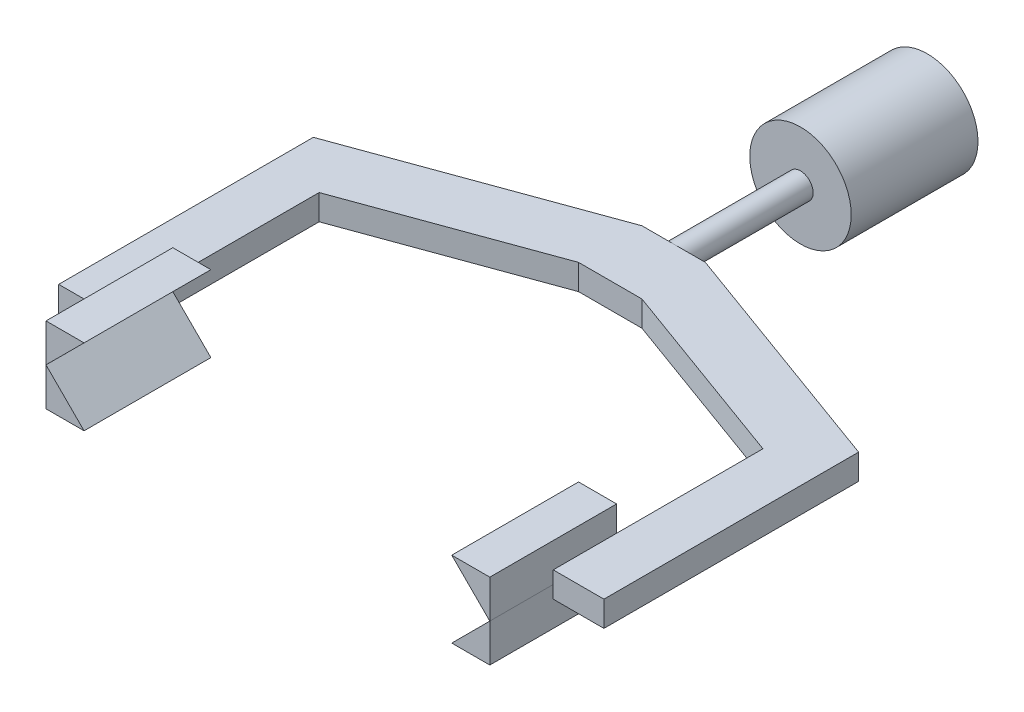
ISO-10303-21;
HEADER;
FILE_DESCRIPTION(('STEP AP214'),'2;1');
FILE_NAME('part.step','',(''),(''),'','','');
FILE_SCHEMA(('AUTOMOTIVE_DESIGN { 1 0 10303 214 1 1 1 1 }'));
ENDSEC;
DATA;
#1=APPLICATION_CONTEXT('core data for automotive mechanical design processes');
#2=APPLICATION_PROTOCOL_DEFINITION('international standard','automotive_design',2000,#1);
#3=PRODUCT_CONTEXT('',#1,'mechanical');
#4=PRODUCT('Part','Part','',(#3));
#5=PRODUCT_RELATED_PRODUCT_CATEGORY('part','',(#4));
#6=PRODUCT_DEFINITION_FORMATION('','',#4);
#7=PRODUCT_DEFINITION_CONTEXT('part definition',#1,'design');
#8=PRODUCT_DEFINITION('design','',#6,#7);
#9=PRODUCT_DEFINITION_SHAPE('','',#8);
#10=(LENGTH_UNIT() NAMED_UNIT(*) SI_UNIT(.MILLI.,.METRE.));
#11=(NAMED_UNIT(*) PLANE_ANGLE_UNIT() SI_UNIT($,.RADIAN.));
#12=(NAMED_UNIT(*) SI_UNIT($,.STERADIAN.) SOLID_ANGLE_UNIT());
#13=UNCERTAINTY_MEASURE_WITH_UNIT(LENGTH_MEASURE(1.E-05),#10,'distance_accuracy_value','');
#14=(GEOMETRIC_REPRESENTATION_CONTEXT(3) GLOBAL_UNCERTAINTY_ASSIGNED_CONTEXT((#13)) GLOBAL_UNIT_ASSIGNED_CONTEXT((#10,
#11,#12)) REPRESENTATION_CONTEXT('',''));
#15=CARTESIAN_POINT('',(0.,0.,0.));
#16=DIRECTION('',(0.,0.,1.));
#17=DIRECTION('',(1.,0.,0.));
#18=AXIS2_PLACEMENT_3D('',#15,#16,#17);
#19=CARTESIAN_POINT('',(-8.743160098785,8.75141339961099,52.));
#20=DIRECTION('',(-0.70677311538271,0.707440289616176,0.));
#21=DIRECTION('',(-0.707440289616176,-0.70677311538271,0.));
#22=AXIS2_PLACEMENT_3D('',#19,#20,#21);
#23=PLANE('',#22);
#24=DIRECTION('',(0.707440289616176,0.70677311538271,0.));
#25=VECTOR('',#24,1.);
#26=CARTESIAN_POINT('',(-8.743160098785,8.75141339961099,42.));
#27=LINE('',#26,#25);
#28=CARTESIAN_POINT('',(-17.5,0.00283191685819875,42.));
#29=VERTEX_POINT('',#28);
#30=CARTESIAN_POINT('',(-14.4971680831418,3.0028319168582,42.));
#31=VERTEX_POINT('',#30);
#32=EDGE_CURVE('E93',#29,#31,#27,.T.);
#33=ORIENTED_EDGE('',*,*,#32,.T.);
#34=DIRECTION('',(0.,0.,-1.));
#35=VECTOR('',#34,1.);
#36=CARTESIAN_POINT('',(-14.4971680831418,3.0028319168582,52.));
#37=LINE('',#36,#35);
#38=CARTESIAN_POINT('',(-14.4971680831418,3.0028319168582,52.));
#39=VERTEX_POINT('',#38);
#40=EDGE_CURVE('E12',#39,#31,#37,.T.);
#41=ORIENTED_EDGE('',*,*,#40,.F.);
#42=DIRECTION('',(0.707440289616176,0.70677311538271,0.));
#43=VECTOR('',#42,1.);
#44=CARTESIAN_POINT('',(-8.743160098785,8.75141339961099,52.));
#45=LINE('',#44,#43);
#46=CARTESIAN_POINT('',(-17.5,0.00283191685819875,52.));
#47=VERTEX_POINT('',#46);
#48=EDGE_CURVE('E86',#47,#39,#45,.T.);
#49=ORIENTED_EDGE('',*,*,#48,.F.);
#50=DIRECTION('',(0.,0.,-1.));
#51=VECTOR('',#50,1.);
#52=CARTESIAN_POINT('',(-17.5,0.00283191685819875,52.));
#53=LINE('',#52,#51);
#54=EDGE_CURVE('E94',#47,#29,#53,.T.);
#55=ORIENTED_EDGE('',*,*,#54,.T.);
#56=EDGE_LOOP('',(#33,#41,#49,#55));
#57=FACE_BOUND('',#56,.T.);
#58=ADVANCED_FACE('F46',(#57),#23,.F.);
#59=CARTESIAN_POINT('',(0.,3.0028319168582,52.));
#60=DIRECTION('',(0.,-1.,0.));
#61=DIRECTION('',(0.,0.,-1.));
#62=AXIS2_PLACEMENT_3D('',#59,#60,#61);
#63=PLANE('',#62);
#64=DIRECTION('',(-1.,0.,0.));
#65=VECTOR('',#64,1.);
#66=CARTESIAN_POINT('',(0.,3.0028319168582,42.));
#67=LINE('',#66,#65);
#68=CARTESIAN_POINT('',(-17.5,3.0028319168582,42.));
#69=VERTEX_POINT('',#68);
#70=EDGE_CURVE('E74',#31,#69,#67,.T.);
#71=ORIENTED_EDGE('',*,*,#70,.T.);
#72=DIRECTION('',(0.,0.,-1.));
#73=VECTOR('',#72,1.);
#74=CARTESIAN_POINT('',(-17.5,3.0028319168582,52.));
#75=LINE('',#74,#73);
#76=CARTESIAN_POINT('',(-17.5,3.0028319168582,52.));
#77=VERTEX_POINT('',#76);
#78=EDGE_CURVE('E54',#77,#69,#75,.T.);
#79=ORIENTED_EDGE('',*,*,#78,.F.);
#80=DIRECTION('',(-1.,0.,0.));
#81=VECTOR('',#80,1.);
#82=CARTESIAN_POINT('',(0.,3.0028319168582,52.));
#83=LINE('',#82,#81);
#84=EDGE_CURVE('E82',#39,#77,#83,.T.);
#85=ORIENTED_EDGE('',*,*,#84,.F.);
#86=ORIENTED_EDGE('',*,*,#40,.T.);
#87=EDGE_LOOP('',(#71,#79,#85,#86));
#88=FACE_BOUND('',#87,.T.);
#89=ADVANCED_FACE('F83',(#88),#63,.F.);
#90=CARTESIAN_POINT('',(-17.5,0.,52.));
#91=DIRECTION('',(1.,0.,0.));
#92=DIRECTION('',(0.,0.,-1.));
#93=AXIS2_PLACEMENT_3D('',#90,#91,#92);
#94=PLANE('',#93);
#95=DIRECTION('',(0.,-1.,0.));
#96=VECTOR('',#95,1.);
#97=CARTESIAN_POINT('',(-17.5,0.,42.));
#98=LINE('',#97,#96);
#99=EDGE_CURVE('E79',#69,#29,#98,.T.);
#100=ORIENTED_EDGE('',*,*,#99,.T.);
#101=ORIENTED_EDGE('',*,*,#54,.F.);
#102=DIRECTION('',(0.,-1.,0.));
#103=VECTOR('',#102,1.);
#104=CARTESIAN_POINT('',(-17.5,0.,52.));
#105=LINE('',#104,#103);
#106=EDGE_CURVE('E62',#77,#47,#105,.T.);
#107=ORIENTED_EDGE('',*,*,#106,.F.);
#108=ORIENTED_EDGE('',*,*,#78,.T.);
#109=EDGE_LOOP('',(#100,#101,#107,#108));
#110=FACE_BOUND('',#109,.T.);
#111=ADVANCED_FACE('F101',(#110),#94,.F.);
#112=CARTESIAN_POINT('',(0.,0.,52.));
#113=DIRECTION('',(0.,0.,1.));
#114=DIRECTION('',(1.,0.,0.));
#115=AXIS2_PLACEMENT_3D('',#112,#113,#114);
#116=PLANE('',#115);
#117=ORIENTED_EDGE('',*,*,#48,.T.);
#118=ORIENTED_EDGE('',*,*,#84,.T.);
#119=ORIENTED_EDGE('',*,*,#106,.T.);
#120=EDGE_LOOP('',(#117,#118,#119));
#121=FACE_BOUND('',#120,.T.);
#122=ADVANCED_FACE('F89',(#121),#116,.T.);
#123=CARTESIAN_POINT('',(0.,0.,42.));
#124=DIRECTION('',(0.,0.,1.));
#125=DIRECTION('',(1.,0.,0.));
#126=AXIS2_PLACEMENT_3D('',#123,#124,#125);
#127=PLANE('',#126);
#128=ORIENTED_EDGE('',*,*,#32,.F.);
#129=ORIENTED_EDGE('',*,*,#99,.F.);
#130=ORIENTED_EDGE('',*,*,#70,.F.);
#131=EDGE_LOOP('',(#128,#129,#130));
#132=FACE_BOUND('',#131,.T.);
#133=ADVANCED_FACE('F102',(#132),#127,.F.);
#134=CLOSED_SHELL('',(#58,#89,#111,#122,#133));
#135=MANIFOLD_SOLID_BREP('B2',#134);
#136=CARTESIAN_POINT('',(-17.5,0.,52.));
#137=DIRECTION('',(-1.,0.,0.));
#138=DIRECTION('',(0.,0.,1.));
#139=AXIS2_PLACEMENT_3D('',#136,#137,#138);
#140=PLANE('',#139);
#141=DIRECTION('',(0.,1.,0.));
#142=VECTOR('',#141,1.);
#143=CARTESIAN_POINT('',(-17.5,0.,42.));
#144=LINE('',#143,#142);
#145=CARTESIAN_POINT('',(-17.5,-3.0028319168582,42.));
#146=VERTEX_POINT('',#145);
#147=CARTESIAN_POINT('',(-17.5,0.,42.));
#148=VERTEX_POINT('',#147);
#149=EDGE_CURVE('E188',#146,#148,#144,.T.);
#150=ORIENTED_EDGE('',*,*,#149,.F.);
#151=DIRECTION('',(0.,0.,-1.));
#152=VECTOR('',#151,1.);
#153=CARTESIAN_POINT('',(-17.5,-3.0028319168582,52.));
#154=LINE('',#153,#152);
#155=CARTESIAN_POINT('',(-17.5,-3.0028319168582,52.));
#156=VERTEX_POINT('',#155);
#157=EDGE_CURVE('E44',#156,#146,#154,.T.);
#158=ORIENTED_EDGE('',*,*,#157,.F.);
#159=DIRECTION('',(0.,1.,0.));
#160=VECTOR('',#159,1.);
#161=CARTESIAN_POINT('',(-17.5,0.,52.));
#162=LINE('',#161,#160);
#163=CARTESIAN_POINT('',(-17.5,0.,52.));
#164=VERTEX_POINT('',#163);
#165=EDGE_CURVE('E186',#156,#164,#162,.T.);
#166=ORIENTED_EDGE('',*,*,#165,.T.);
#167=DIRECTION('',(0.,0.,-1.));
#168=VECTOR('',#167,1.);
#169=CARTESIAN_POINT('',(-17.5,0.,52.));
#170=LINE('',#169,#168);
#171=EDGE_CURVE('E170',#164,#148,#170,.T.);
#172=ORIENTED_EDGE('',*,*,#171,.T.);
#173=EDGE_LOOP('',(#150,#158,#166,#172));
#174=FACE_BOUND('',#173,.T.);
#175=ADVANCED_FACE('F154',(#174),#140,.T.);
#176=CARTESIAN_POINT('',(0.,-3.0028319168582,52.));
#177=DIRECTION('',(0.,-1.,0.));
#178=DIRECTION('',(0.,0.,-1.));
#179=AXIS2_PLACEMENT_3D('',#176,#177,#178);
#180=PLANE('',#179);
#181=DIRECTION('',(-1.,0.,0.));
#182=VECTOR('',#181,1.);
#183=CARTESIAN_POINT('',(0.,-3.0028319168582,42.));
#184=LINE('',#183,#182);
#185=CARTESIAN_POINT('',(-14.4971680831418,-3.0028319168582,42.));
#186=VERTEX_POINT('',#185);
#187=EDGE_CURVE('E204',#186,#146,#184,.T.);
#188=ORIENTED_EDGE('',*,*,#187,.F.);
#189=DIRECTION('',(0.,0.,-1.));
#190=VECTOR('',#189,1.);
#191=CARTESIAN_POINT('',(-14.4971680831418,-3.0028319168582,52.));
#192=LINE('',#191,#190);
#193=CARTESIAN_POINT('',(-14.4971680831418,-3.0028319168582,52.));
#194=VERTEX_POINT('',#193);
#195=EDGE_CURVE('E162',#194,#186,#192,.T.);
#196=ORIENTED_EDGE('',*,*,#195,.F.);
#197=DIRECTION('',(-1.,0.,0.));
#198=VECTOR('',#197,1.);
#199=CARTESIAN_POINT('',(0.,-3.0028319168582,52.));
#200=LINE('',#199,#198);
#201=EDGE_CURVE('E195',#194,#156,#200,.T.);
#202=ORIENTED_EDGE('',*,*,#201,.T.);
#203=ORIENTED_EDGE('',*,*,#157,.T.);
#204=EDGE_LOOP('',(#188,#196,#202,#203));
#205=FACE_BOUND('',#204,.T.);
#206=ADVANCED_FACE('F199',(#205),#180,.T.);
#207=CARTESIAN_POINT('',(-8.74999999999991,-8.75,52.));
#208=DIRECTION('',(0.707106781186544,0.707106781186551,0.));
#209=DIRECTION('',(-0.707106781186551,0.707106781186544,0.));
#210=AXIS2_PLACEMENT_3D('',#207,#208,#209);
#211=PLANE('',#210);
#212=DIRECTION('',(0.707106781186551,-0.707106781186544,0.));
#213=VECTOR('',#212,1.);
#214=CARTESIAN_POINT('',(-8.74999999999991,-8.75,42.));
#215=LINE('',#214,#213);
#216=EDGE_CURVE('E197',#148,#186,#215,.T.);
#217=ORIENTED_EDGE('',*,*,#216,.F.);
#218=ORIENTED_EDGE('',*,*,#171,.F.);
#219=DIRECTION('',(0.707106781186551,-0.707106781186544,0.));
#220=VECTOR('',#219,1.);
#221=CARTESIAN_POINT('',(-8.74999999999991,-8.75,52.));
#222=LINE('',#221,#220);
#223=EDGE_CURVE('E196',#164,#194,#222,.T.);
#224=ORIENTED_EDGE('',*,*,#223,.T.);
#225=ORIENTED_EDGE('',*,*,#195,.T.);
#226=EDGE_LOOP('',(#217,#218,#224,#225));
#227=FACE_BOUND('',#226,.T.);
#228=ADVANCED_FACE('F210',(#227),#211,.T.);
#229=CARTESIAN_POINT('',(0.,0.,52.));
#230=DIRECTION('',(0.,0.,1.));
#231=DIRECTION('',(1.,0.,0.));
#232=AXIS2_PLACEMENT_3D('',#229,#230,#231);
#233=PLANE('',#232);
#234=ORIENTED_EDGE('',*,*,#165,.F.);
#235=ORIENTED_EDGE('',*,*,#201,.F.);
#236=ORIENTED_EDGE('',*,*,#223,.F.);
#237=EDGE_LOOP('',(#234,#235,#236));
#238=FACE_BOUND('',#237,.T.);
#239=ADVANCED_FACE('F194',(#238),#233,.T.);
#240=CARTESIAN_POINT('',(0.,0.,42.));
#241=DIRECTION('',(0.,0.,1.));
#242=DIRECTION('',(1.,0.,0.));
#243=AXIS2_PLACEMENT_3D('',#240,#241,#242);
#244=PLANE('',#243);
#245=ORIENTED_EDGE('',*,*,#149,.T.);
#246=ORIENTED_EDGE('',*,*,#216,.T.);
#247=ORIENTED_EDGE('',*,*,#187,.T.);
#248=EDGE_LOOP('',(#245,#246,#247));
#249=FACE_BOUND('',#248,.T.);
#250=ADVANCED_FACE('F209',(#249),#244,.F.);
#251=CLOSED_SHELL('',(#175,#206,#228,#239,#250));
#252=MANIFOLD_SOLID_BREP('B6',#251);
#253=CARTESIAN_POINT('',(8.74999999999991,-8.75,52.));
#254=DIRECTION('',(0.707106781186544,-0.707106781186551,0.));
#255=DIRECTION('',(0.707106781186551,0.707106781186544,0.));
#256=AXIS2_PLACEMENT_3D('',#253,#254,#255);
#257=PLANE('',#256);
#258=DIRECTION('',(-0.707106781186551,-0.707106781186544,0.));
#259=VECTOR('',#258,1.);
#260=CARTESIAN_POINT('',(8.74999999999991,-8.75,42.));
#261=LINE('',#260,#259);
#262=CARTESIAN_POINT('',(17.5,0.,42.));
#263=VERTEX_POINT('',#262);
#264=CARTESIAN_POINT('',(14.4971680831418,-3.0028319168582,42.));
#265=VERTEX_POINT('',#264);
#266=EDGE_CURVE('E309',#263,#265,#261,.T.);
#267=ORIENTED_EDGE('',*,*,#266,.T.);
#268=DIRECTION('',(0.,0.,-1.));
#269=VECTOR('',#268,1.);
#270=CARTESIAN_POINT('',(14.4971680831418,-3.0028319168582,52.));
#271=LINE('',#270,#269);
#272=CARTESIAN_POINT('',(14.4971680831418,-3.0028319168582,52.));
#273=VERTEX_POINT('',#272);
#274=EDGE_CURVE('E152',#273,#265,#271,.T.);
#275=ORIENTED_EDGE('',*,*,#274,.F.);
#276=DIRECTION('',(-0.707106781186551,-0.707106781186544,0.));
#277=VECTOR('',#276,1.);
#278=CARTESIAN_POINT('',(8.74999999999991,-8.75,52.));
#279=LINE('',#278,#277);
#280=CARTESIAN_POINT('',(17.5,0.,52.));
#281=VERTEX_POINT('',#280);
#282=EDGE_CURVE('E302',#281,#273,#279,.T.);
#283=ORIENTED_EDGE('',*,*,#282,.F.);
#284=DIRECTION('',(0.,0.,-1.));
#285=VECTOR('',#284,1.);
#286=CARTESIAN_POINT('',(17.5,0.,52.));
#287=LINE('',#286,#285);
#288=EDGE_CURVE('E310',#281,#263,#287,.T.);
#289=ORIENTED_EDGE('',*,*,#288,.T.);
#290=EDGE_LOOP('',(#267,#275,#283,#289));
#291=FACE_BOUND('',#290,.T.);
#292=ADVANCED_FACE('F262',(#291),#257,.F.);
#293=CARTESIAN_POINT('',(0.,-3.0028319168582,52.));
#294=DIRECTION('',(0.,1.,0.));
#295=DIRECTION('',(0.,0.,1.));
#296=AXIS2_PLACEMENT_3D('',#293,#294,#295);
#297=PLANE('',#296);
#298=DIRECTION('',(1.,0.,0.));
#299=VECTOR('',#298,1.);
#300=CARTESIAN_POINT('',(0.,-3.0028319168582,42.));
#301=LINE('',#300,#299);
#302=CARTESIAN_POINT('',(17.5,-3.0028319168582,42.));
#303=VERTEX_POINT('',#302);
#304=EDGE_CURVE('E290',#265,#303,#301,.T.);
#305=ORIENTED_EDGE('',*,*,#304,.T.);
#306=DIRECTION('',(0.,0.,-1.));
#307=VECTOR('',#306,1.);
#308=CARTESIAN_POINT('',(17.5,-3.0028319168582,52.));
#309=LINE('',#308,#307);
#310=CARTESIAN_POINT('',(17.5,-3.0028319168582,52.));
#311=VERTEX_POINT('',#310);
#312=EDGE_CURVE('E270',#311,#303,#309,.T.);
#313=ORIENTED_EDGE('',*,*,#312,.F.);
#314=DIRECTION('',(1.,0.,0.));
#315=VECTOR('',#314,1.);
#316=CARTESIAN_POINT('',(0.,-3.0028319168582,52.));
#317=LINE('',#316,#315);
#318=EDGE_CURVE('E298',#273,#311,#317,.T.);
#319=ORIENTED_EDGE('',*,*,#318,.F.);
#320=ORIENTED_EDGE('',*,*,#274,.T.);
#321=EDGE_LOOP('',(#305,#313,#319,#320));
#322=FACE_BOUND('',#321,.T.);
#323=ADVANCED_FACE('F299',(#322),#297,.F.);
#324=CARTESIAN_POINT('',(17.5,0.,52.));
#325=DIRECTION('',(-1.,0.,0.));
#326=DIRECTION('',(0.,0.,1.));
#327=AXIS2_PLACEMENT_3D('',#324,#325,#326);
#328=PLANE('',#327);
#329=DIRECTION('',(0.,1.,0.));
#330=VECTOR('',#329,1.);
#331=CARTESIAN_POINT('',(17.5,0.,42.));
#332=LINE('',#331,#330);
#333=EDGE_CURVE('E295',#303,#263,#332,.T.);
#334=ORIENTED_EDGE('',*,*,#333,.T.);
#335=ORIENTED_EDGE('',*,*,#288,.F.);
#336=DIRECTION('',(0.,1.,0.));
#337=VECTOR('',#336,1.);
#338=CARTESIAN_POINT('',(17.5,0.,52.));
#339=LINE('',#338,#337);
#340=EDGE_CURVE('E278',#311,#281,#339,.T.);
#341=ORIENTED_EDGE('',*,*,#340,.F.);
#342=ORIENTED_EDGE('',*,*,#312,.T.);
#343=EDGE_LOOP('',(#334,#335,#341,#342));
#344=FACE_BOUND('',#343,.T.);
#345=ADVANCED_FACE('F317',(#344),#328,.F.);
#346=CARTESIAN_POINT('',(0.,0.,52.));
#347=DIRECTION('',(0.,0.,1.));
#348=DIRECTION('',(1.,0.,0.));
#349=AXIS2_PLACEMENT_3D('',#346,#347,#348);
#350=PLANE('',#349);
#351=ORIENTED_EDGE('',*,*,#282,.T.);
#352=ORIENTED_EDGE('',*,*,#318,.T.);
#353=ORIENTED_EDGE('',*,*,#340,.T.);
#354=EDGE_LOOP('',(#351,#352,#353));
#355=FACE_BOUND('',#354,.T.);
#356=ADVANCED_FACE('F305',(#355),#350,.T.);
#357=CARTESIAN_POINT('',(0.,0.,42.));
#358=DIRECTION('',(0.,0.,1.));
#359=DIRECTION('',(1.,0.,0.));
#360=AXIS2_PLACEMENT_3D('',#357,#358,#359);
#361=PLANE('',#360);
#362=ORIENTED_EDGE('',*,*,#266,.F.);
#363=ORIENTED_EDGE('',*,*,#333,.F.);
#364=ORIENTED_EDGE('',*,*,#304,.F.);
#365=EDGE_LOOP('',(#362,#363,#364));
#366=FACE_BOUND('',#365,.T.);
#367=ADVANCED_FACE('F318',(#366),#361,.F.);
#368=CLOSED_SHELL('',(#292,#323,#345,#356,#367));
#369=MANIFOLD_SOLID_BREP('B38',#368);
#370=CARTESIAN_POINT('',(17.5,0.,52.));
#371=DIRECTION('',(1.,0.,0.));
#372=DIRECTION('',(0.,0.,-1.));
#373=AXIS2_PLACEMENT_3D('',#370,#371,#372);
#374=PLANE('',#373);
#375=DIRECTION('',(0.,-1.,0.));
#376=VECTOR('',#375,1.);
#377=CARTESIAN_POINT('',(17.5,0.,42.));
#378=LINE('',#377,#376);
#379=CARTESIAN_POINT('',(17.5,3.0028319168582,42.));
#380=VERTEX_POINT('',#379);
#381=CARTESIAN_POINT('',(17.5,0.,42.));
#382=VERTEX_POINT('',#381);
#383=EDGE_CURVE('E406',#380,#382,#378,.T.);
#384=ORIENTED_EDGE('',*,*,#383,.F.);
#385=DIRECTION('',(0.,0.,-1.));
#386=VECTOR('',#385,1.);
#387=CARTESIAN_POINT('',(17.5,3.0028319168582,52.));
#388=LINE('',#387,#386);
#389=CARTESIAN_POINT('',(17.5,3.0028319168582,52.));
#390=VERTEX_POINT('',#389);
#391=EDGE_CURVE('E260',#390,#380,#388,.T.);
#392=ORIENTED_EDGE('',*,*,#391,.F.);
#393=DIRECTION('',(0.,-1.,0.));
#394=VECTOR('',#393,1.);
#395=CARTESIAN_POINT('',(17.5,0.,52.));
#396=LINE('',#395,#394);
#397=CARTESIAN_POINT('',(17.5,0.,52.));
#398=VERTEX_POINT('',#397);
#399=EDGE_CURVE('E404',#390,#398,#396,.T.);
#400=ORIENTED_EDGE('',*,*,#399,.T.);
#401=DIRECTION('',(0.,0.,-1.));
#402=VECTOR('',#401,1.);
#403=CARTESIAN_POINT('',(17.5,0.,52.));
#404=LINE('',#403,#402);
#405=EDGE_CURVE('E388',#398,#382,#404,.T.);
#406=ORIENTED_EDGE('',*,*,#405,.T.);
#407=EDGE_LOOP('',(#384,#392,#400,#406));
#408=FACE_BOUND('',#407,.T.);
#409=ADVANCED_FACE('F372',(#408),#374,.T.);
#410=CARTESIAN_POINT('',(0.,3.0028319168582,52.));
#411=DIRECTION('',(0.,1.,0.));
#412=DIRECTION('',(0.,0.,1.));
#413=AXIS2_PLACEMENT_3D('',#410,#411,#412);
#414=PLANE('',#413);
#415=DIRECTION('',(1.,0.,0.));
#416=VECTOR('',#415,1.);
#417=CARTESIAN_POINT('',(0.,3.0028319168582,42.));
#418=LINE('',#417,#416);
#419=CARTESIAN_POINT('',(14.4971680831418,3.0028319168582,42.));
#420=VERTEX_POINT('',#419);
#421=EDGE_CURVE('E422',#420,#380,#418,.T.);
#422=ORIENTED_EDGE('',*,*,#421,.F.);
#423=DIRECTION('',(0.,0.,-1.));
#424=VECTOR('',#423,1.);
#425=CARTESIAN_POINT('',(14.4971680831418,3.0028319168582,52.));
#426=LINE('',#425,#424);
#427=CARTESIAN_POINT('',(14.4971680831418,3.0028319168582,52.));
#428=VERTEX_POINT('',#427);
#429=EDGE_CURVE('E380',#428,#420,#426,.T.);
#430=ORIENTED_EDGE('',*,*,#429,.F.);
#431=DIRECTION('',(1.,0.,0.));
#432=VECTOR('',#431,1.);
#433=CARTESIAN_POINT('',(0.,3.0028319168582,52.));
#434=LINE('',#433,#432);
#435=EDGE_CURVE('E413',#428,#390,#434,.T.);
#436=ORIENTED_EDGE('',*,*,#435,.T.);
#437=ORIENTED_EDGE('',*,*,#391,.T.);
#438=EDGE_LOOP('',(#422,#430,#436,#437));
#439=FACE_BOUND('',#438,.T.);
#440=ADVANCED_FACE('F417',(#439),#414,.T.);
#441=CARTESIAN_POINT('',(8.74999999999991,8.75,52.));
#442=DIRECTION('',(-0.707106781186544,-0.707106781186551,0.));
#443=DIRECTION('',(0.707106781186551,-0.707106781186544,0.));
#444=AXIS2_PLACEMENT_3D('',#441,#442,#443);
#445=PLANE('',#444);
#446=DIRECTION('',(-0.707106781186551,0.707106781186544,0.));
#447=VECTOR('',#446,1.);
#448=CARTESIAN_POINT('',(8.74999999999991,8.75,42.));
#449=LINE('',#448,#447);
#450=EDGE_CURVE('E415',#382,#420,#449,.T.);
#451=ORIENTED_EDGE('',*,*,#450,.F.);
#452=ORIENTED_EDGE('',*,*,#405,.F.);
#453=DIRECTION('',(-0.707106781186551,0.707106781186544,0.));
#454=VECTOR('',#453,1.);
#455=CARTESIAN_POINT('',(8.74999999999991,8.75,52.));
#456=LINE('',#455,#454);
#457=EDGE_CURVE('E414',#398,#428,#456,.T.);
#458=ORIENTED_EDGE('',*,*,#457,.T.);
#459=ORIENTED_EDGE('',*,*,#429,.T.);
#460=EDGE_LOOP('',(#451,#452,#458,#459));
#461=FACE_BOUND('',#460,.T.);
#462=ADVANCED_FACE('F428',(#461),#445,.T.);
#463=CARTESIAN_POINT('',(0.,0.,52.));
#464=DIRECTION('',(0.,0.,1.));
#465=DIRECTION('',(1.,0.,0.));
#466=AXIS2_PLACEMENT_3D('',#463,#464,#465);
#467=PLANE('',#466);
#468=ORIENTED_EDGE('',*,*,#399,.F.);
#469=ORIENTED_EDGE('',*,*,#435,.F.);
#470=ORIENTED_EDGE('',*,*,#457,.F.);
#471=EDGE_LOOP('',(#468,#469,#470));
#472=FACE_BOUND('',#471,.T.);
#473=ADVANCED_FACE('F412',(#472),#467,.T.);
#474=CARTESIAN_POINT('',(0.,0.,42.));
#475=DIRECTION('',(0.,0.,1.));
#476=DIRECTION('',(1.,0.,0.));
#477=AXIS2_PLACEMENT_3D('',#474,#475,#476);
#478=PLANE('',#477);
#479=ORIENTED_EDGE('',*,*,#383,.T.);
#480=ORIENTED_EDGE('',*,*,#450,.T.);
#481=ORIENTED_EDGE('',*,*,#421,.T.);
#482=EDGE_LOOP('',(#479,#480,#481));
#483=FACE_BOUND('',#482,.T.);
#484=ADVANCED_FACE('F427',(#483),#478,.F.);
#485=CLOSED_SHELL('',(#409,#440,#462,#473,#484));
#486=MANIFOLD_SOLID_BREP('B146',#485);
#487=CARTESIAN_POINT('',(0.,0.,10.));
#488=DIRECTION('',(0.,0.,-1.));
#489=DIRECTION('',(-1.,0.,0.));
#490=AXIS2_PLACEMENT_3D('',#487,#488,#489);
#491=CYLINDRICAL_SURFACE('',#490,4.);
#492=CARTESIAN_POINT('',(0.,0.,10.));
#493=DIRECTION('',(0.,0.,1.));
#494=DIRECTION('',(1.,0.,0.));
#495=AXIS2_PLACEMENT_3D('',#492,#493,#494);
#496=CIRCLE('',#495,4.);
#497=CARTESIAN_POINT('',(4.,0.,10.));
#498=VERTEX_POINT('',#497);
#499=EDGE_CURVE('E484',#498,#498,#496,.T.);
#500=ORIENTED_EDGE('',*,*,#499,.F.);
#501=EDGE_LOOP('',(#500));
#502=FACE_BOUND('',#501,.T.);
#503=CARTESIAN_POINT('',(0.,0.,0.));
#504=DIRECTION('',(0.,0.,1.));
#505=DIRECTION('',(1.,0.,0.));
#506=AXIS2_PLACEMENT_3D('',#503,#504,#505);
#507=CIRCLE('',#506,4.);
#508=CARTESIAN_POINT('',(4.,0.,0.));
#509=VERTEX_POINT('',#508);
#510=EDGE_CURVE('E479',#509,#509,#507,.T.);
#511=ORIENTED_EDGE('',*,*,#510,.T.);
#512=EDGE_LOOP('',(#511));
#513=FACE_BOUND('',#512,.T.);
#514=ADVANCED_FACE('F476',(#502,#513),#491,.T.);
#515=CARTESIAN_POINT('',(0.,0.,10.));
#516=DIRECTION('',(0.,0.,1.));
#517=DIRECTION('',(1.,0.,0.));
#518=AXIS2_PLACEMENT_3D('',#515,#516,#517);
#519=PLANE('',#518);
#520=CARTESIAN_POINT('',(0.,0.,10.));
#521=DIRECTION('',(0.,0.,1.));
#522=DIRECTION('',(1.,0.,0.));
#523=AXIS2_PLACEMENT_3D('',#520,#521,#522);
#524=CIRCLE('',#523,1.);
#525=CARTESIAN_POINT('',(1.,0.,10.));
#526=VERTEX_POINT('',#525);
#527=EDGE_CURVE('E370',#526,#526,#524,.T.);
#528=ORIENTED_EDGE('',*,*,#527,.F.);
#529=EDGE_LOOP('',(#528));
#530=FACE_BOUND('',#529,.T.);
#531=ORIENTED_EDGE('',*,*,#499,.T.);
#532=EDGE_LOOP('',(#531));
#533=FACE_BOUND('',#532,.T.);
#534=ADVANCED_FACE('F685',(#530,#533),#519,.T.);
#535=CARTESIAN_POINT('',(0.,0.,0.));
#536=DIRECTION('',(0.,0.,1.));
#537=DIRECTION('',(1.,0.,0.));
#538=AXIS2_PLACEMENT_3D('',#535,#536,#537);
#539=PLANE('',#538);
#540=ORIENTED_EDGE('',*,*,#510,.F.);
#541=EDGE_LOOP('',(#540));
#542=FACE_BOUND('',#541,.T.);
#543=ADVANCED_FACE('F682',(#542),#539,.F.);
#544=CARTESIAN_POINT('',(0.,0.,20.));
#545=DIRECTION('',(0.,0.,-1.));
#546=DIRECTION('',(-1.,0.,0.));
#547=AXIS2_PLACEMENT_3D('',#544,#545,#546);
#548=CYLINDRICAL_SURFACE('',#547,1.);
#549=CARTESIAN_POINT('',(0.,0.,20.));
#550=DIRECTION('',(0.,0.,1.));
#551=DIRECTION('',(1.,0.,0.));
#552=AXIS2_PLACEMENT_3D('',#549,#550,#551);
#553=CIRCLE('',#552,1.);
#554=CARTESIAN_POINT('',(0.,1.,20.));
#555=VERTEX_POINT('',#554);
#556=CARTESIAN_POINT('',(0.,-1.,20.));
#557=VERTEX_POINT('',#556);
#558=EDGE_CURVE('E494',#555,#557,#553,.T.);
#559=ORIENTED_EDGE('',*,*,#558,.F.);
#560=EDGE_CURVE('E491',#557,#555,#553,.T.);
#561=ORIENTED_EDGE('',*,*,#560,.F.);
#562=EDGE_LOOP('',(#559,#561));
#563=FACE_BOUND('',#562,.T.);
#564=ORIENTED_EDGE('',*,*,#527,.T.);
#565=EDGE_LOOP('',(#564));
#566=FACE_BOUND('',#565,.T.);
#567=ADVANCED_FACE('F684',(#563,#566),#548,.T.);
#568=CARTESIAN_POINT('',(-2.5,1.,20.));
#569=DIRECTION('',(0.,0.,1.));
#570=DIRECTION('',(1.,0.,0.));
#571=AXIS2_PLACEMENT_3D('',#568,#569,#570);
#572=PLANE('',#571);
#573=DIRECTION('',(-1.,0.,0.));
#574=VECTOR('',#573,1.);
#575=CARTESIAN_POINT('',(-2.5,1.,20.));
#576=LINE('',#575,#574);
#577=CARTESIAN_POINT('',(-2.5,1.,20.));
#578=VERTEX_POINT('',#577);
#579=EDGE_CURVE('E591',#555,#578,#576,.T.);
#580=ORIENTED_EDGE('',*,*,#579,.F.);
#581=ORIENTED_EDGE('',*,*,#558,.T.);
#582=DIRECTION('',(-1.,0.,0.));
#583=VECTOR('',#582,1.);
#584=CARTESIAN_POINT('',(-2.5,-1.,20.));
#585=LINE('',#584,#583);
#586=CARTESIAN_POINT('',(-2.5,-1.,20.));
#587=VERTEX_POINT('',#586);
#588=EDGE_CURVE('E663',#557,#587,#585,.T.);
#589=ORIENTED_EDGE('',*,*,#588,.T.);
#590=DIRECTION('',(0.,-1.,0.));
#591=VECTOR('',#590,1.);
#592=CARTESIAN_POINT('',(-2.5,1.,20.));
#593=LINE('',#592,#591);
#594=EDGE_CURVE('E661',#578,#587,#593,.T.);
#595=ORIENTED_EDGE('',*,*,#594,.F.);
#596=EDGE_LOOP('',(#580,#581,#589,#595));
#597=FACE_BOUND('',#596,.T.);
#598=ADVANCED_FACE('F690',(#597),#572,.F.);
#599=CARTESIAN_POINT('',(2.5,-1.,20.));
#600=VERTEX_POINT('',#599);
#601=EDGE_CURVE('E658',#600,#557,#585,.T.);
#602=ORIENTED_EDGE('',*,*,#601,.T.);
#603=ORIENTED_EDGE('',*,*,#560,.T.);
#604=CARTESIAN_POINT('',(2.5,1.,20.));
#605=VERTEX_POINT('',#604);
#606=EDGE_CURVE('E659',#605,#555,#576,.T.);
#607=ORIENTED_EDGE('',*,*,#606,.F.);
#608=DIRECTION('',(0.,-1.,0.));
#609=VECTOR('',#608,1.);
#610=CARTESIAN_POINT('',(2.5,1.,20.));
#611=LINE('',#610,#609);
#612=EDGE_CURVE('E667',#605,#600,#611,.T.);
#613=ORIENTED_EDGE('',*,*,#612,.T.);
#614=EDGE_LOOP('',(#602,#603,#607,#613));
#615=FACE_BOUND('',#614,.T.);
#616=ADVANCED_FACE('F717',(#615),#572,.F.);
#617=CARTESIAN_POINT('',(-2.5,1.,25.));
#618=DIRECTION('',(0.,0.,-1.));
#619=DIRECTION('',(-1.,0.,0.));
#620=AXIS2_PLACEMENT_3D('',#617,#618,#619);
#621=PLANE('',#620);
#622=DIRECTION('',(1.,0.,0.));
#623=VECTOR('',#622,1.);
#624=CARTESIAN_POINT('',(-2.5,-1.,25.));
#625=LINE('',#624,#623);
#626=CARTESIAN_POINT('',(-2.5,-1.,25.));
#627=VERTEX_POINT('',#626);
#628=CARTESIAN_POINT('',(2.5,-1.,25.));
#629=VERTEX_POINT('',#628);
#630=EDGE_CURVE('E655',#627,#629,#625,.T.);
#631=ORIENTED_EDGE('',*,*,#630,.T.);
#632=DIRECTION('',(0.,-1.,0.));
#633=VECTOR('',#632,1.);
#634=CARTESIAN_POINT('',(2.5,1.,25.));
#635=LINE('',#634,#633);
#636=CARTESIAN_POINT('',(2.5,1.,25.));
#637=VERTEX_POINT('',#636);
#638=EDGE_CURVE('E669',#637,#629,#635,.T.);
#639=ORIENTED_EDGE('',*,*,#638,.F.);
#640=DIRECTION('',(1.,0.,0.));
#641=VECTOR('',#640,1.);
#642=CARTESIAN_POINT('',(-2.5,1.,25.));
#643=LINE('',#642,#641);
#644=CARTESIAN_POINT('',(-2.5,1.,25.));
#645=VERTEX_POINT('',#644);
#646=EDGE_CURVE('E656',#645,#637,#643,.T.);
#647=ORIENTED_EDGE('',*,*,#646,.F.);
#648=DIRECTION('',(0.,-1.,0.));
#649=VECTOR('',#648,1.);
#650=CARTESIAN_POINT('',(-2.5,1.,25.));
#651=LINE('',#650,#649);
#652=EDGE_CURVE('E672',#645,#627,#651,.T.);
#653=ORIENTED_EDGE('',*,*,#652,.T.);
#654=EDGE_LOOP('',(#631,#639,#647,#653));
#655=FACE_BOUND('',#654,.T.);
#656=ADVANCED_FACE('F722',(#655),#621,.F.);
#657=CARTESIAN_POINT('',(0.,1.,0.));
#658=DIRECTION('',(0.,1.,0.));
#659=DIRECTION('',(0.,0.,1.));
#660=AXIS2_PLACEMENT_3D('',#657,#658,#659);
#661=PLANE('',#660);
#662=ORIENTED_EDGE('',*,*,#579,.T.);
#663=DIRECTION('',(0.939692620785907,0.,-0.342020143325673));
#664=VECTOR('',#663,1.);
#665=CARTESIAN_POINT('',(-2.5,1.,20.));
#666=LINE('',#665,#664);
#667=CARTESIAN_POINT('',(-21.5,1.,26.9154344510579));
#668=VERTEX_POINT('',#667);
#669=EDGE_CURVE('E573',#668,#578,#666,.T.);
#670=ORIENTED_EDGE('',*,*,#669,.F.);
#671=DIRECTION('',(0.,0.,-1.));
#672=VECTOR('',#671,1.);
#673=CARTESIAN_POINT('',(-21.5,1.,26.9154344510579));
#674=LINE('',#673,#672);
#675=CARTESIAN_POINT('',(-21.5,1.,47.));
#676=VERTEX_POINT('',#675);
#677=EDGE_CURVE('E587',#676,#668,#674,.T.);
#678=ORIENTED_EDGE('',*,*,#677,.F.);
#679=DIRECTION('',(-1.,0.,0.));
#680=VECTOR('',#679,1.);
#681=CARTESIAN_POINT('',(-21.5,1.,47.));
#682=LINE('',#681,#680);
#683=CARTESIAN_POINT('',(-17.5,1.,47.));
#684=VERTEX_POINT('',#683);
#685=EDGE_CURVE('E596',#684,#676,#682,.T.);
#686=ORIENTED_EDGE('',*,*,#685,.F.);
#687=DIRECTION('',(0.,0.,1.));
#688=VECTOR('',#687,1.);
#689=CARTESIAN_POINT('',(-17.5,1.,47.));
#690=LINE('',#689,#688);
#691=CARTESIAN_POINT('',(-17.5,1.,30.4595535139931));
#692=VERTEX_POINT('',#691);
#693=EDGE_CURVE('E598',#692,#684,#690,.T.);
#694=ORIENTED_EDGE('',*,*,#693,.F.);
#695=DIRECTION('',(-0.939692620785907,0.,0.342020143325673));
#696=VECTOR('',#695,1.);
#697=CARTESIAN_POINT('',(-17.5,1.,30.4595535139931));
#698=LINE('',#697,#696);
#699=EDGE_CURVE('E603',#645,#692,#698,.T.);
#700=ORIENTED_EDGE('',*,*,#699,.F.);
#701=ORIENTED_EDGE('',*,*,#646,.T.);
#702=DIRECTION('',(0.939692620785907,0.,0.342020143325673));
#703=VECTOR('',#702,1.);
#704=CARTESIAN_POINT('',(17.5,1.,30.4595535139931));
#705=LINE('',#704,#703);
#706=CARTESIAN_POINT('',(17.5,1.,30.4595535139931));
#707=VERTEX_POINT('',#706);
#708=EDGE_CURVE('E622',#637,#707,#705,.T.);
#709=ORIENTED_EDGE('',*,*,#708,.T.);
#710=DIRECTION('',(0.,0.,1.));
#711=VECTOR('',#710,1.);
#712=CARTESIAN_POINT('',(17.5,1.,47.));
#713=LINE('',#712,#711);
#714=CARTESIAN_POINT('',(17.5,1.,47.));
#715=VERTEX_POINT('',#714);
#716=EDGE_CURVE('E624',#707,#715,#713,.T.);
#717=ORIENTED_EDGE('',*,*,#716,.T.);
#718=DIRECTION('',(1.,0.,0.));
#719=VECTOR('',#718,1.);
#720=CARTESIAN_POINT('',(21.5,1.,47.));
#721=LINE('',#720,#719);
#722=CARTESIAN_POINT('',(21.5,1.,47.));
#723=VERTEX_POINT('',#722);
#724=EDGE_CURVE('E627',#715,#723,#721,.T.);
#725=ORIENTED_EDGE('',*,*,#724,.T.);
#726=DIRECTION('',(0.,0.,-1.));
#727=VECTOR('',#726,1.);
#728=CARTESIAN_POINT('',(21.5,1.,26.9154344510579));
#729=LINE('',#728,#727);
#730=CARTESIAN_POINT('',(21.5,1.,26.9154344510579));
#731=VERTEX_POINT('',#730);
#732=EDGE_CURVE('E629',#723,#731,#729,.T.);
#733=ORIENTED_EDGE('',*,*,#732,.T.);
#734=DIRECTION('',(-0.939692620785907,0.,-0.342020143325673));
#735=VECTOR('',#734,1.);
#736=CARTESIAN_POINT('',(2.5,1.,20.));
#737=LINE('',#736,#735);
#738=EDGE_CURVE('E631',#731,#605,#737,.T.);
#739=ORIENTED_EDGE('',*,*,#738,.T.);
#740=ORIENTED_EDGE('',*,*,#606,.T.);
#741=EDGE_LOOP('',(#662,#670,#678,#686,#694,#700,#701,#709,#717,#725,#733,#739,#740));
#742=FACE_BOUND('',#741,.T.);
#743=ADVANCED_FACE('F585',(#742),#661,.T.);
#744=CARTESIAN_POINT('',(0.,-1.,0.));
#745=DIRECTION('',(0.,1.,0.));
#746=DIRECTION('',(0.,0.,1.));
#747=AXIS2_PLACEMENT_3D('',#744,#745,#746);
#748=PLANE('',#747);
#749=ORIENTED_EDGE('',*,*,#630,.F.);
#750=DIRECTION('',(-0.939692620785907,0.,0.342020143325673));
#751=VECTOR('',#750,1.);
#752=CARTESIAN_POINT('',(-17.5,-1.,30.4595535139931));
#753=LINE('',#752,#751);
#754=CARTESIAN_POINT('',(-17.5,-1.,30.4595535139931));
#755=VERTEX_POINT('',#754);
#756=EDGE_CURVE('E593',#627,#755,#753,.T.);
#757=ORIENTED_EDGE('',*,*,#756,.T.);
#758=DIRECTION('',(0.,0.,1.));
#759=VECTOR('',#758,1.);
#760=CARTESIAN_POINT('',(-17.5,-1.,47.));
#761=LINE('',#760,#759);
#762=CARTESIAN_POINT('',(-17.5,-1.,47.));
#763=VERTEX_POINT('',#762);
#764=EDGE_CURVE('E613',#755,#763,#761,.T.);
#765=ORIENTED_EDGE('',*,*,#764,.T.);
#766=DIRECTION('',(-1.,0.,0.));
#767=VECTOR('',#766,1.);
#768=CARTESIAN_POINT('',(-21.5,-1.,47.));
#769=LINE('',#768,#767);
#770=CARTESIAN_POINT('',(-21.5,-1.,47.));
#771=VERTEX_POINT('',#770);
#772=EDGE_CURVE('E610',#763,#771,#769,.T.);
#773=ORIENTED_EDGE('',*,*,#772,.T.);
#774=DIRECTION('',(0.,0.,-1.));
#775=VECTOR('',#774,1.);
#776=CARTESIAN_POINT('',(-21.5,-1.,26.9154344510579));
#777=LINE('',#776,#775);
#778=CARTESIAN_POINT('',(-21.5,-1.,26.9154344510579));
#779=VERTEX_POINT('',#778);
#780=EDGE_CURVE('E608',#771,#779,#777,.T.);
#781=ORIENTED_EDGE('',*,*,#780,.T.);
#782=DIRECTION('',(0.939692620785907,0.,-0.342020143325673));
#783=VECTOR('',#782,1.);
#784=CARTESIAN_POINT('',(-2.5,-1.,20.));
#785=LINE('',#784,#783);
#786=EDGE_CURVE('E575',#779,#587,#785,.T.);
#787=ORIENTED_EDGE('',*,*,#786,.T.);
#788=ORIENTED_EDGE('',*,*,#588,.F.);
#789=ORIENTED_EDGE('',*,*,#601,.F.);
#790=DIRECTION('',(-0.939692620785907,0.,-0.342020143325673));
#791=VECTOR('',#790,1.);
#792=CARTESIAN_POINT('',(2.5,-1.,20.));
#793=LINE('',#792,#791);
#794=CARTESIAN_POINT('',(21.5,-1.,26.9154344510579));
#795=VERTEX_POINT('',#794);
#796=EDGE_CURVE('E625',#795,#600,#793,.T.);
#797=ORIENTED_EDGE('',*,*,#796,.F.);
#798=DIRECTION('',(0.,0.,-1.));
#799=VECTOR('',#798,1.);
#800=CARTESIAN_POINT('',(21.5,-1.,26.9154344510579));
#801=LINE('',#800,#799);
#802=CARTESIAN_POINT('',(21.5,-1.,47.));
#803=VERTEX_POINT('',#802);
#804=EDGE_CURVE('E640',#803,#795,#801,.T.);
#805=ORIENTED_EDGE('',*,*,#804,.F.);
#806=DIRECTION('',(1.,0.,0.));
#807=VECTOR('',#806,1.);
#808=CARTESIAN_POINT('',(21.5,-1.,47.));
#809=LINE('',#808,#807);
#810=CARTESIAN_POINT('',(17.5,-1.,47.));
#811=VERTEX_POINT('',#810);
#812=EDGE_CURVE('E638',#811,#803,#809,.T.);
#813=ORIENTED_EDGE('',*,*,#812,.F.);
#814=DIRECTION('',(0.,0.,1.));
#815=VECTOR('',#814,1.);
#816=CARTESIAN_POINT('',(17.5,-1.,47.));
#817=LINE('',#816,#815);
#818=CARTESIAN_POINT('',(17.5,-1.,30.4595535139931));
#819=VERTEX_POINT('',#818);
#820=EDGE_CURVE('E636',#819,#811,#817,.T.);
#821=ORIENTED_EDGE('',*,*,#820,.F.);
#822=DIRECTION('',(0.939692620785907,0.,0.342020143325673));
#823=VECTOR('',#822,1.);
#824=CARTESIAN_POINT('',(17.5,-1.,30.4595535139931));
#825=LINE('',#824,#823);
#826=EDGE_CURVE('E580',#629,#819,#825,.T.);
#827=ORIENTED_EDGE('',*,*,#826,.F.);
#828=EDGE_LOOP('',(#749,#757,#765,#773,#781,#787,#788,#789,#797,#805,#813,#821,#827));
#829=FACE_BOUND('',#828,.T.);
#830=ADVANCED_FACE('F736',(#829),#748,.F.);
#831=CARTESIAN_POINT('',(17.5,1.,30.4595535139931));
#832=DIRECTION('',(0.342020143325673,0.,-0.939692620785907));
#833=DIRECTION('',(-0.939692620785907,0.,-0.342020143325673));
#834=AXIS2_PLACEMENT_3D('',#831,#832,#833);
#835=PLANE('',#834);
#836=ORIENTED_EDGE('',*,*,#826,.T.);
#837=DIRECTION('',(0.,-1.,0.));
#838=VECTOR('',#837,1.);
#839=CARTESIAN_POINT('',(17.5,1.,30.4595535139931));
#840=LINE('',#839,#838);
#841=EDGE_CURVE('E652',#707,#819,#840,.T.);
#842=ORIENTED_EDGE('',*,*,#841,.F.);
#843=ORIENTED_EDGE('',*,*,#708,.F.);
#844=ORIENTED_EDGE('',*,*,#638,.T.);
#845=EDGE_LOOP('',(#836,#842,#843,#844));
#846=FACE_BOUND('',#845,.T.);
#847=ADVANCED_FACE('F730',(#846),#835,.F.);
#848=CARTESIAN_POINT('',(17.5,1.,47.));
#849=DIRECTION('',(1.,0.,0.));
#850=DIRECTION('',(0.,0.,-1.));
#851=AXIS2_PLACEMENT_3D('',#848,#849,#850);
#852=PLANE('',#851);
#853=ORIENTED_EDGE('',*,*,#820,.T.);
#854=DIRECTION('',(0.,-1.,0.));
#855=VECTOR('',#854,1.);
#856=CARTESIAN_POINT('',(17.5,1.,47.));
#857=LINE('',#856,#855);
#858=EDGE_CURVE('E649',#715,#811,#857,.T.);
#859=ORIENTED_EDGE('',*,*,#858,.F.);
#860=ORIENTED_EDGE('',*,*,#716,.F.);
#861=ORIENTED_EDGE('',*,*,#841,.T.);
#862=EDGE_LOOP('',(#853,#859,#860,#861));
#863=FACE_BOUND('',#862,.T.);
#864=ADVANCED_FACE('F735',(#863),#852,.F.);
#865=CARTESIAN_POINT('',(21.5,1.,47.));
#866=DIRECTION('',(0.,0.,-1.));
#867=DIRECTION('',(-1.,0.,0.));
#868=AXIS2_PLACEMENT_3D('',#865,#866,#867);
#869=PLANE('',#868);
#870=ORIENTED_EDGE('',*,*,#812,.T.);
#871=DIRECTION('',(0.,-1.,0.));
#872=VECTOR('',#871,1.);
#873=CARTESIAN_POINT('',(21.5,1.,47.));
#874=LINE('',#873,#872);
#875=EDGE_CURVE('E646',#723,#803,#874,.T.);
#876=ORIENTED_EDGE('',*,*,#875,.F.);
#877=ORIENTED_EDGE('',*,*,#724,.F.);
#878=ORIENTED_EDGE('',*,*,#858,.T.);
#879=EDGE_LOOP('',(#870,#876,#877,#878));
#880=FACE_BOUND('',#879,.T.);
#881=ADVANCED_FACE('F748',(#880),#869,.F.);
#882=CARTESIAN_POINT('',(21.5,1.,26.9154344510579));
#883=DIRECTION('',(-1.,0.,0.));
#884=DIRECTION('',(0.,0.,1.));
#885=AXIS2_PLACEMENT_3D('',#882,#883,#884);
#886=PLANE('',#885);
#887=ORIENTED_EDGE('',*,*,#804,.T.);
#888=DIRECTION('',(0.,-1.,0.));
#889=VECTOR('',#888,1.);
#890=CARTESIAN_POINT('',(21.5,1.,26.9154344510579));
#891=LINE('',#890,#889);
#892=EDGE_CURVE('E634',#731,#795,#891,.T.);
#893=ORIENTED_EDGE('',*,*,#892,.F.);
#894=ORIENTED_EDGE('',*,*,#732,.F.);
#895=ORIENTED_EDGE('',*,*,#875,.T.);
#896=EDGE_LOOP('',(#887,#893,#894,#895));
#897=FACE_BOUND('',#896,.T.);
#898=ADVANCED_FACE('F758',(#897),#886,.F.);
#899=CARTESIAN_POINT('',(2.5,1.,20.));
#900=DIRECTION('',(-0.342020143325673,0.,0.939692620785907));
#901=DIRECTION('',(0.939692620785907,0.,0.342020143325673));
#902=AXIS2_PLACEMENT_3D('',#899,#900,#901);
#903=PLANE('',#902);
#904=ORIENTED_EDGE('',*,*,#796,.T.);
#905=ORIENTED_EDGE('',*,*,#612,.F.);
#906=ORIENTED_EDGE('',*,*,#738,.F.);
#907=ORIENTED_EDGE('',*,*,#892,.T.);
#908=EDGE_LOOP('',(#904,#905,#906,#907));
#909=FACE_BOUND('',#908,.T.);
#910=ADVANCED_FACE('F768',(#909),#903,.F.);
#911=CARTESIAN_POINT('',(-2.5,1.,20.));
#912=DIRECTION('',(-0.342020143325673,0.,-0.939692620785907));
#913=DIRECTION('',(-0.939692620785907,0.,0.342020143325673));
#914=AXIS2_PLACEMENT_3D('',#911,#912,#913);
#915=PLANE('',#914);
#916=ORIENTED_EDGE('',*,*,#786,.F.);
#917=DIRECTION('',(0.,-1.,0.));
#918=VECTOR('',#917,1.);
#919=CARTESIAN_POINT('',(-21.5,1.,26.9154344510579));
#920=LINE('',#919,#918);
#921=EDGE_CURVE('E569',#668,#779,#920,.T.);
#922=ORIENTED_EDGE('',*,*,#921,.F.);
#923=ORIENTED_EDGE('',*,*,#669,.T.);
#924=ORIENTED_EDGE('',*,*,#594,.T.);
#925=EDGE_LOOP('',(#916,#922,#923,#924));
#926=FACE_BOUND('',#925,.T.);
#927=ADVANCED_FACE('F571',(#926),#915,.T.);
#928=CARTESIAN_POINT('',(-21.5,1.,26.9154344510579));
#929=DIRECTION('',(-1.,0.,0.));
#930=DIRECTION('',(0.,0.,1.));
#931=AXIS2_PLACEMENT_3D('',#928,#929,#930);
#932=PLANE('',#931);
#933=ORIENTED_EDGE('',*,*,#780,.F.);
#934=DIRECTION('',(0.,-1.,0.));
#935=VECTOR('',#934,1.);
#936=CARTESIAN_POINT('',(-21.5,1.,47.));
#937=LINE('',#936,#935);
#938=EDGE_CURVE('E581',#676,#771,#937,.T.);
#939=ORIENTED_EDGE('',*,*,#938,.F.);
#940=ORIENTED_EDGE('',*,*,#677,.T.);
#941=ORIENTED_EDGE('',*,*,#921,.T.);
#942=EDGE_LOOP('',(#933,#939,#940,#941));
#943=FACE_BOUND('',#942,.T.);
#944=ADVANCED_FACE('F595',(#943),#932,.T.);
#945=CARTESIAN_POINT('',(-21.5,1.,47.));
#946=DIRECTION('',(0.,0.,1.));
#947=DIRECTION('',(1.,0.,0.));
#948=AXIS2_PLACEMENT_3D('',#945,#946,#947);
#949=PLANE('',#948);
#950=ORIENTED_EDGE('',*,*,#772,.F.);
#951=DIRECTION('',(0.,-1.,0.));
#952=VECTOR('',#951,1.);
#953=CARTESIAN_POINT('',(-17.5,1.,47.));
#954=LINE('',#953,#952);
#955=EDGE_CURVE('E619',#684,#763,#954,.T.);
#956=ORIENTED_EDGE('',*,*,#955,.F.);
#957=ORIENTED_EDGE('',*,*,#685,.T.);
#958=ORIENTED_EDGE('',*,*,#938,.T.);
#959=EDGE_LOOP('',(#950,#956,#957,#958));
#960=FACE_BOUND('',#959,.T.);
#961=ADVANCED_FACE('F826',(#960),#949,.T.);
#962=CARTESIAN_POINT('',(-17.5,1.,47.));
#963=DIRECTION('',(1.,0.,0.));
#964=DIRECTION('',(0.,0.,-1.));
#965=AXIS2_PLACEMENT_3D('',#962,#963,#964);
#966=PLANE('',#965);
#967=ORIENTED_EDGE('',*,*,#764,.F.);
#968=DIRECTION('',(0.,-1.,0.));
#969=VECTOR('',#968,1.);
#970=CARTESIAN_POINT('',(-17.5,1.,30.4595535139931));
#971=LINE('',#970,#969);
#972=EDGE_CURVE('E606',#692,#755,#971,.T.);
#973=ORIENTED_EDGE('',*,*,#972,.F.);
#974=ORIENTED_EDGE('',*,*,#693,.T.);
#975=ORIENTED_EDGE('',*,*,#955,.T.);
#976=EDGE_LOOP('',(#967,#973,#974,#975));
#977=FACE_BOUND('',#976,.T.);
#978=ADVANCED_FACE('F835',(#977),#966,.T.);
#979=CARTESIAN_POINT('',(-17.5,1.,30.4595535139931));
#980=DIRECTION('',(0.342020143325673,0.,0.939692620785907));
#981=DIRECTION('',(0.939692620785907,0.,-0.342020143325673));
#982=AXIS2_PLACEMENT_3D('',#979,#980,#981);
#983=PLANE('',#982);
#984=ORIENTED_EDGE('',*,*,#756,.F.);
#985=ORIENTED_EDGE('',*,*,#652,.F.);
#986=ORIENTED_EDGE('',*,*,#699,.T.);
#987=ORIENTED_EDGE('',*,*,#972,.T.);
#988=EDGE_LOOP('',(#984,#985,#986,#987));
#989=FACE_BOUND('',#988,.T.);
#990=ADVANCED_FACE('F845',(#989),#983,.T.);
#991=CLOSED_SHELL('',(#514,#534,#543,#567,#598,#616,#656,#743,#830,#847,#864,#881,#898,#910,
#927,#944,#961,#978,#990));
#992=MANIFOLD_SOLID_BREP('B254',#991);
#993=ADVANCED_BREP_SHAPE_REPRESENTATION('',(#18,#135,#252,#369,#486,#992),#14);
#994=SHAPE_DEFINITION_REPRESENTATION(#9,#993);
ENDSEC;
END-ISO-10303-21;
